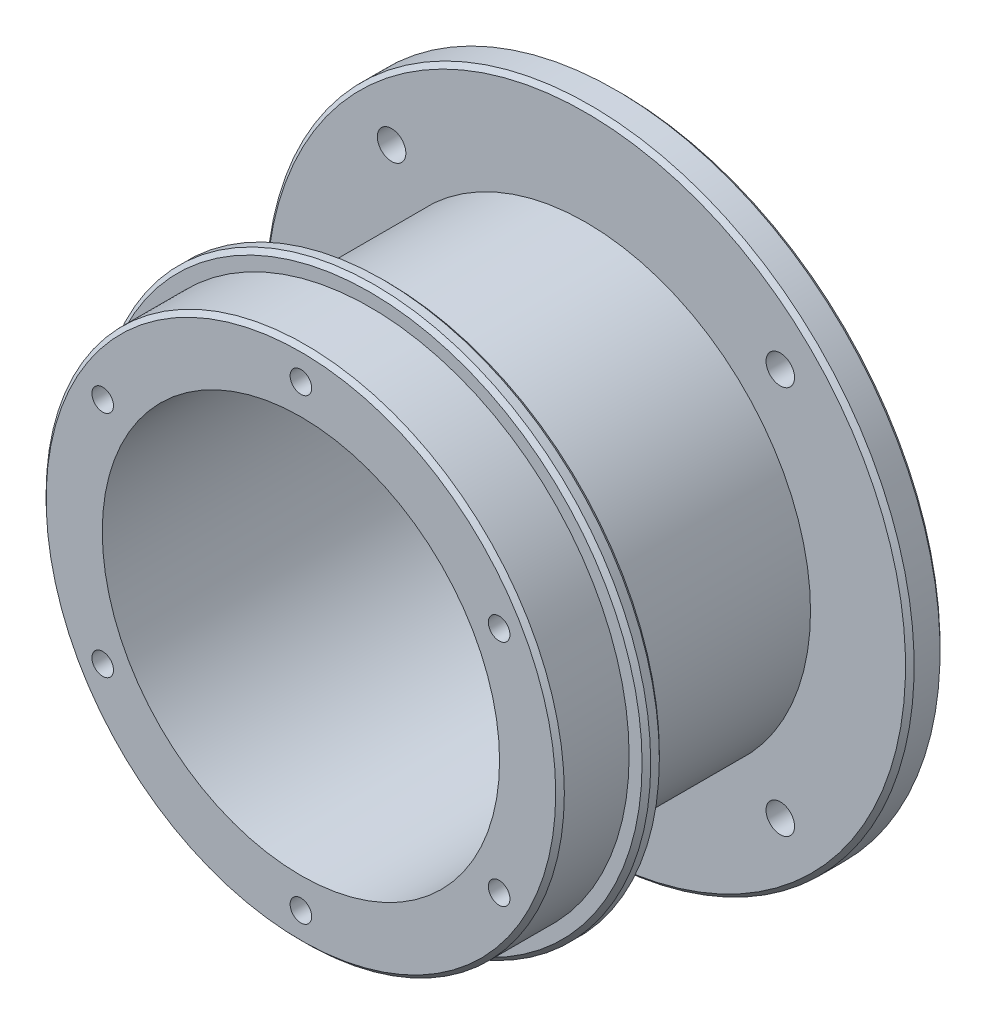
ISO-10303-21;
HEADER;
FILE_DESCRIPTION(('STEP AP214'),'2;1');
FILE_NAME('part.step','',(''),(''),'','','');
FILE_SCHEMA(('AUTOMOTIVE_DESIGN { 1 0 10303 214 1 1 1 1 }'));
ENDSEC;
DATA;
#1=APPLICATION_CONTEXT('core data for automotive mechanical design processes');
#2=APPLICATION_PROTOCOL_DEFINITION('international standard','automotive_design',2000,#1);
#3=PRODUCT_CONTEXT('',#1,'mechanical');
#4=PRODUCT('Part','Part','',(#3));
#5=PRODUCT_RELATED_PRODUCT_CATEGORY('part','',(#4));
#6=PRODUCT_DEFINITION_FORMATION('','',#4);
#7=PRODUCT_DEFINITION_CONTEXT('part definition',#1,'design');
#8=PRODUCT_DEFINITION('design','',#6,#7);
#9=PRODUCT_DEFINITION_SHAPE('','',#8);
#10=(LENGTH_UNIT() NAMED_UNIT(*) SI_UNIT(.MILLI.,.METRE.));
#11=(NAMED_UNIT(*) PLANE_ANGLE_UNIT() SI_UNIT($,.RADIAN.));
#12=(NAMED_UNIT(*) SI_UNIT($,.STERADIAN.) SOLID_ANGLE_UNIT());
#13=UNCERTAINTY_MEASURE_WITH_UNIT(LENGTH_MEASURE(1.E-05),#10,'distance_accuracy_value','');
#14=(GEOMETRIC_REPRESENTATION_CONTEXT(3) GLOBAL_UNCERTAINTY_ASSIGNED_CONTEXT((#13)) GLOBAL_UNIT_ASSIGNED_CONTEXT((#10,
#11,#12)) REPRESENTATION_CONTEXT('',''));
#15=CARTESIAN_POINT('',(0.,0.,0.));
#16=DIRECTION('',(0.,0.,1.));
#17=DIRECTION('',(1.,0.,0.));
#18=AXIS2_PLACEMENT_3D('',#15,#16,#17);
#19=CARTESIAN_POINT('',(0.,0.,0.));
#20=DIRECTION('',(0.,0.,1.));
#21=DIRECTION('',(1.,0.,0.));
#22=AXIS2_PLACEMENT_3D('',#19,#20,#21);
#23=PLANE('',#22);
#24=CARTESIAN_POINT('',(0.,0.,0.));
#25=DIRECTION('',(0.,0.,1.));
#26=DIRECTION('',(1.,0.,0.));
#27=AXIS2_PLACEMENT_3D('',#24,#25,#26);
#28=CIRCLE('',#27,31.5);
#29=CARTESIAN_POINT('',(31.5,0.,0.));
#30=VERTEX_POINT('',#29);
#31=EDGE_CURVE('E156',#30,#30,#28,.F.);
#32=ORIENTED_EDGE('',*,*,#31,.T.);
#33=EDGE_LOOP('',(#32));
#34=FACE_BOUND('',#33,.T.);
#35=CARTESIAN_POINT('',(0.,0.,0.));
#36=DIRECTION('',(0.,0.,1.));
#37=DIRECTION('',(1.,0.,0.));
#38=AXIS2_PLACEMENT_3D('',#35,#36,#37);
#39=CIRCLE('',#38,26.);
#40=CARTESIAN_POINT('',(26.,0.,0.));
#41=VERTEX_POINT('',#40);
#42=EDGE_CURVE('E146',#41,#41,#39,.F.);
#43=ORIENTED_EDGE('',*,*,#42,.F.);
#44=EDGE_LOOP('',(#43));
#45=FACE_BOUND('',#44,.T.);
#46=ADVANCED_FACE('F42',(#34,#45),#23,.F.);
#47=CARTESIAN_POINT('',(0.,0.,2.));
#48=DIRECTION('',(0.,0.,-1.));
#49=DIRECTION('',(-1.,0.,0.));
#50=AXIS2_PLACEMENT_3D('',#47,#48,#49);
#51=CYLINDRICAL_SURFACE('',#50,32.);
#52=CARTESIAN_POINT('',(0.,0.,1.50000000000001));
#53=DIRECTION('',(0.,0.,1.));
#54=DIRECTION('',(1.,0.,0.));
#55=AXIS2_PLACEMENT_3D('',#52,#53,#54);
#56=CIRCLE('',#55,32.);
#57=CARTESIAN_POINT('',(32.,0.,1.50000000000001));
#58=VERTEX_POINT('',#57);
#59=EDGE_CURVE('E11',#58,#58,#56,.F.);
#60=ORIENTED_EDGE('',*,*,#59,.T.);
#61=EDGE_LOOP('',(#60));
#62=FACE_BOUND('',#61,.T.);
#63=CARTESIAN_POINT('',(0.,0.,0.500000000000007));
#64=DIRECTION('',(0.,0.,1.));
#65=DIRECTION('',(1.,0.,0.));
#66=AXIS2_PLACEMENT_3D('',#63,#64,#65);
#67=CIRCLE('',#66,32.);
#68=CARTESIAN_POINT('',(32.,0.,0.500000000000007));
#69=VERTEX_POINT('',#68);
#70=EDGE_CURVE('E149',#69,#69,#67,.T.);
#71=ORIENTED_EDGE('',*,*,#70,.T.);
#72=EDGE_LOOP('',(#71));
#73=FACE_BOUND('',#72,.T.);
#74=ADVANCED_FACE('F192',(#62,#73),#51,.T.);
#75=CARTESIAN_POINT('',(0.,0.,2.));
#76=DIRECTION('',(0.,0.,1.));
#77=DIRECTION('',(1.,0.,0.));
#78=AXIS2_PLACEMENT_3D('',#75,#76,#77);
#79=PLANE('',#78);
#80=CARTESIAN_POINT('',(0.,0.,2.));
#81=DIRECTION('',(0.,0.,1.));
#82=DIRECTION('',(1.,0.,0.));
#83=AXIS2_PLACEMENT_3D('',#80,#81,#82);
#84=CIRCLE('',#83,31.5);
#85=CARTESIAN_POINT('',(31.5,0.,2.));
#86=VERTEX_POINT('',#85);
#87=EDGE_CURVE('E50',#86,#86,#84,.T.);
#88=ORIENTED_EDGE('',*,*,#87,.T.);
#89=EDGE_LOOP('',(#88));
#90=FACE_BOUND('',#89,.T.);
#91=CARTESIAN_POINT('',(0.,0.,2.));
#92=DIRECTION('',(0.,0.,1.));
#93=DIRECTION('',(1.,0.,0.));
#94=AXIS2_PLACEMENT_3D('',#91,#92,#93);
#95=CIRCLE('',#94,30.);
#96=CARTESIAN_POINT('',(30.,0.,2.));
#97=VERTEX_POINT('',#96);
#98=EDGE_CURVE('E143',#97,#97,#95,.T.);
#99=ORIENTED_EDGE('',*,*,#98,.F.);
#100=EDGE_LOOP('',(#99));
#101=FACE_BOUND('',#100,.T.);
#102=ADVANCED_FACE('F179',(#90,#101),#79,.T.);
#103=CARTESIAN_POINT('',(0.,0.,10.));
#104=DIRECTION('',(0.,0.,-1.));
#105=DIRECTION('',(-1.,0.,0.));
#106=AXIS2_PLACEMENT_3D('',#103,#104,#105);
#107=CYLINDRICAL_SURFACE('',#106,30.);
#108=CARTESIAN_POINT('',(0.,0.,9.49999999999998));
#109=DIRECTION('',(0.,0.,1.));
#110=DIRECTION('',(1.,0.,0.));
#111=AXIS2_PLACEMENT_3D('',#108,#109,#110);
#112=CIRCLE('',#111,30.);
#113=CARTESIAN_POINT('',(30.,0.,9.49999999999998));
#114=VERTEX_POINT('',#113);
#115=EDGE_CURVE('E174',#114,#114,#112,.F.);
#116=ORIENTED_EDGE('',*,*,#115,.T.);
#117=EDGE_LOOP('',(#116));
#118=FACE_BOUND('',#117,.T.);
#119=ORIENTED_EDGE('',*,*,#98,.T.);
#120=EDGE_LOOP('',(#119));
#121=FACE_BOUND('',#120,.T.);
#122=ADVANCED_FACE('F250',(#118,#121),#107,.T.);
#123=CARTESIAN_POINT('',(0.,0.,10.));
#124=DIRECTION('',(0.,0.,1.));
#125=DIRECTION('',(1.,0.,0.));
#126=AXIS2_PLACEMENT_3D('',#123,#124,#125);
#127=PLANE('',#126);
#128=CARTESIAN_POINT('',(0.,0.,10.));
#129=DIRECTION('',(0.,0.,1.));
#130=DIRECTION('',(1.,0.,0.));
#131=AXIS2_PLACEMENT_3D('',#128,#129,#130);
#132=CIRCLE('',#131,29.5);
#133=CARTESIAN_POINT('',(29.5,0.,10.));
#134=VERTEX_POINT('',#133);
#135=EDGE_CURVE('E171',#134,#134,#132,.T.);
#136=ORIENTED_EDGE('',*,*,#135,.T.);
#137=EDGE_LOOP('',(#136));
#138=FACE_BOUND('',#137,.T.);
#139=CARTESIAN_POINT('',(0.,-26.5,10.));
#140=DIRECTION('',(0.,0.,1.));
#141=DIRECTION('',(1.,0.,0.));
#142=AXIS2_PLACEMENT_3D('',#139,#140,#141);
#143=CIRCLE('',#142,1.25);
#144=CARTESIAN_POINT('',(1.25,-26.5,10.));
#145=VERTEX_POINT('',#144);
#146=EDGE_CURVE('E80',#145,#145,#143,.T.);
#147=ORIENTED_EDGE('',*,*,#146,.F.);
#148=EDGE_LOOP('',(#147));
#149=FACE_BOUND('',#148,.T.);
#150=CARTESIAN_POINT('',(22.9496732002876,-13.25,10.));
#151=DIRECTION('',(0.,0.,1.));
#152=DIRECTION('',(1.,0.,0.));
#153=AXIS2_PLACEMENT_3D('',#150,#151,#152);
#154=CIRCLE('',#153,1.25);
#155=CARTESIAN_POINT('',(24.1996732002876,-13.25,10.));
#156=VERTEX_POINT('',#155);
#157=EDGE_CURVE('E79',#156,#156,#154,.T.);
#158=ORIENTED_EDGE('',*,*,#157,.F.);
#159=EDGE_LOOP('',(#158));
#160=FACE_BOUND('',#159,.T.);
#161=CARTESIAN_POINT('',(22.9496732002876,13.25,10.));
#162=DIRECTION('',(0.,0.,1.));
#163=DIRECTION('',(1.,0.,0.));
#164=AXIS2_PLACEMENT_3D('',#161,#162,#163);
#165=CIRCLE('',#164,1.25);
#166=CARTESIAN_POINT('',(24.1996732002876,13.25,10.));
#167=VERTEX_POINT('',#166);
#168=EDGE_CURVE('E90',#167,#167,#165,.T.);
#169=ORIENTED_EDGE('',*,*,#168,.F.);
#170=EDGE_LOOP('',(#169));
#171=FACE_BOUND('',#170,.T.);
#172=CARTESIAN_POINT('',(0.,26.5,10.));
#173=DIRECTION('',(0.,0.,1.));
#174=DIRECTION('',(1.,0.,0.));
#175=AXIS2_PLACEMENT_3D('',#172,#173,#174);
#176=CIRCLE('',#175,1.25);
#177=CARTESIAN_POINT('',(1.25,26.5,10.));
#178=VERTEX_POINT('',#177);
#179=EDGE_CURVE('E96',#178,#178,#176,.T.);
#180=ORIENTED_EDGE('',*,*,#179,.F.);
#181=EDGE_LOOP('',(#180));
#182=FACE_BOUND('',#181,.T.);
#183=CARTESIAN_POINT('',(-22.9496732002876,13.25,10.));
#184=DIRECTION('',(0.,0.,1.));
#185=DIRECTION('',(1.,0.,0.));
#186=AXIS2_PLACEMENT_3D('',#183,#184,#185);
#187=CIRCLE('',#186,1.25);
#188=CARTESIAN_POINT('',(-21.6996732002876,13.25,10.));
#189=VERTEX_POINT('',#188);
#190=EDGE_CURVE('E102',#189,#189,#187,.T.);
#191=ORIENTED_EDGE('',*,*,#190,.F.);
#192=EDGE_LOOP('',(#191));
#193=FACE_BOUND('',#192,.T.);
#194=CARTESIAN_POINT('',(-22.9496732002876,-13.25,10.));
#195=DIRECTION('',(0.,0.,1.));
#196=DIRECTION('',(1.,0.,0.));
#197=AXIS2_PLACEMENT_3D('',#194,#195,#196);
#198=CIRCLE('',#197,1.25);
#199=CARTESIAN_POINT('',(-21.6996732002876,-13.25,10.));
#200=VERTEX_POINT('',#199);
#201=EDGE_CURVE('E108',#200,#200,#198,.T.);
#202=ORIENTED_EDGE('',*,*,#201,.F.);
#203=EDGE_LOOP('',(#202));
#204=FACE_BOUND('',#203,.T.);
#205=CARTESIAN_POINT('',(0.,0.,10.));
#206=DIRECTION('',(0.,0.,-1.));
#207=DIRECTION('',(-1.,0.,0.));
#208=AXIS2_PLACEMENT_3D('',#205,#206,#207);
#209=CIRCLE('',#208,23.);
#210=CARTESIAN_POINT('',(-23.,0.,10.));
#211=VERTEX_POINT('',#210);
#212=EDGE_CURVE('E140',#211,#211,#209,.T.);
#213=ORIENTED_EDGE('',*,*,#212,.T.);
#214=EDGE_LOOP('',(#213));
#215=FACE_BOUND('',#214,.T.);
#216=ADVANCED_FACE('F241',(#138,#149,#160,#171,#182,#193,#204,#215),#127,.T.);
#217=CARTESIAN_POINT('',(0.,0.,10.));
#218=DIRECTION('',(0.,0.,-1.));
#219=DIRECTION('',(-1.,0.,0.));
#220=AXIS2_PLACEMENT_3D('',#217,#218,#219);
#221=CYLINDRICAL_SURFACE('',#220,23.);
#222=ORIENTED_EDGE('',*,*,#212,.F.);
#223=EDGE_LOOP('',(#222));
#224=FACE_BOUND('',#223,.T.);
#225=CARTESIAN_POINT('',(0.,0.,-27.));
#226=DIRECTION('',(0.,0.,-1.));
#227=DIRECTION('',(-1.,0.,0.));
#228=AXIS2_PLACEMENT_3D('',#225,#226,#227);
#229=CIRCLE('',#228,23.);
#230=CARTESIAN_POINT('',(-23.,0.,-27.));
#231=VERTEX_POINT('',#230);
#232=EDGE_CURVE('E134',#231,#231,#229,.F.);
#233=ORIENTED_EDGE('',*,*,#232,.F.);
#234=EDGE_LOOP('',(#233));
#235=FACE_BOUND('',#234,.T.);
#236=ADVANCED_FACE('F238',(#224,#235),#221,.F.);
#237=CARTESIAN_POINT('',(0.,0.,-23.));
#238=DIRECTION('',(0.,0.,1.));
#239=DIRECTION('',(1.,0.,0.));
#240=AXIS2_PLACEMENT_3D('',#237,#238,#239);
#241=CYLINDRICAL_SURFACE('',#240,26.);
#242=CARTESIAN_POINT('',(0.,0.,-23.));
#243=DIRECTION('',(0.,0.,-1.));
#244=DIRECTION('',(-1.,0.,0.));
#245=AXIS2_PLACEMENT_3D('',#242,#243,#244);
#246=CIRCLE('',#245,26.);
#247=CARTESIAN_POINT('',(-26.,0.,-23.));
#248=VERTEX_POINT('',#247);
#249=EDGE_CURVE('E137',#248,#248,#246,.T.);
#250=ORIENTED_EDGE('',*,*,#249,.F.);
#251=EDGE_LOOP('',(#250));
#252=FACE_BOUND('',#251,.T.);
#253=ORIENTED_EDGE('',*,*,#42,.T.);
#254=EDGE_LOOP('',(#253));
#255=FACE_BOUND('',#254,.T.);
#256=ADVANCED_FACE('F240',(#252,#255),#241,.T.);
#257=CARTESIAN_POINT('',(0.,0.,-27.));
#258=DIRECTION('',(0.,0.,1.));
#259=DIRECTION('',(1.,0.,0.));
#260=AXIS2_PLACEMENT_3D('',#257,#258,#259);
#261=CYLINDRICAL_SURFACE('',#260,37.5);
#262=CARTESIAN_POINT('',(0.,0.,-23.5));
#263=DIRECTION('',(0.,0.,-1.));
#264=DIRECTION('',(-1.,0.,0.));
#265=AXIS2_PLACEMENT_3D('',#262,#263,#264);
#266=CIRCLE('',#265,37.5);
#267=CARTESIAN_POINT('',(-37.5,0.,-23.5));
#268=VERTEX_POINT('',#267);
#269=EDGE_CURVE('E162',#268,#268,#266,.T.);
#270=ORIENTED_EDGE('',*,*,#269,.T.);
#271=EDGE_LOOP('',(#270));
#272=FACE_BOUND('',#271,.T.);
#273=CARTESIAN_POINT('',(0.,0.,-26.5));
#274=DIRECTION('',(0.,0.,-1.));
#275=DIRECTION('',(-1.,0.,0.));
#276=AXIS2_PLACEMENT_3D('',#273,#274,#275);
#277=CIRCLE('',#276,37.5);
#278=CARTESIAN_POINT('',(-37.5,0.,-26.5));
#279=VERTEX_POINT('',#278);
#280=EDGE_CURVE('E159',#279,#279,#277,.F.);
#281=ORIENTED_EDGE('',*,*,#280,.T.);
#282=EDGE_LOOP('',(#281));
#283=FACE_BOUND('',#282,.T.);
#284=ADVANCED_FACE('F226',(#272,#283),#261,.T.);
#285=CARTESIAN_POINT('',(0.,0.,-27.));
#286=DIRECTION('',(0.,0.,-1.));
#287=DIRECTION('',(-1.,0.,0.));
#288=AXIS2_PLACEMENT_3D('',#285,#286,#287);
#289=PLANE('',#288);
#290=CARTESIAN_POINT('',(0.,0.,-27.));
#291=DIRECTION('',(0.,0.,-1.));
#292=DIRECTION('',(-1.,0.,0.));
#293=AXIS2_PLACEMENT_3D('',#290,#291,#292);
#294=CIRCLE('',#293,37.);
#295=CARTESIAN_POINT('',(-37.,0.,-27.));
#296=VERTEX_POINT('',#295);
#297=EDGE_CURVE('E168',#296,#296,#294,.T.);
#298=ORIENTED_EDGE('',*,*,#297,.T.);
#299=EDGE_LOOP('',(#298));
#300=FACE_BOUND('',#299,.T.);
#301=CARTESIAN_POINT('',(-22.5,-22.5,-27.));
#302=DIRECTION('',(0.,0.,-1.));
#303=DIRECTION('',(-1.,0.,0.));
#304=AXIS2_PLACEMENT_3D('',#301,#302,#303);
#305=CIRCLE('',#304,1.64999999999999);
#306=CARTESIAN_POINT('',(-24.15,-22.5,-27.));
#307=VERTEX_POINT('',#306);
#308=EDGE_CURVE('E114',#307,#307,#305,.T.);
#309=ORIENTED_EDGE('',*,*,#308,.F.);
#310=EDGE_LOOP('',(#309));
#311=FACE_BOUND('',#310,.T.);
#312=CARTESIAN_POINT('',(-22.5,22.5,-27.));
#313=DIRECTION('',(0.,0.,-1.));
#314=DIRECTION('',(-1.,0.,0.));
#315=AXIS2_PLACEMENT_3D('',#312,#313,#314);
#316=CIRCLE('',#315,1.64999999999999);
#317=CARTESIAN_POINT('',(-24.15,22.5,-27.));
#318=VERTEX_POINT('',#317);
#319=EDGE_CURVE('E118',#318,#318,#316,.T.);
#320=ORIENTED_EDGE('',*,*,#319,.F.);
#321=EDGE_LOOP('',(#320));
#322=FACE_BOUND('',#321,.T.);
#323=CARTESIAN_POINT('',(22.5,-22.5,-27.));
#324=DIRECTION('',(0.,0.,-1.));
#325=DIRECTION('',(-1.,0.,0.));
#326=AXIS2_PLACEMENT_3D('',#323,#324,#325);
#327=CIRCLE('',#326,1.64999999999999);
#328=CARTESIAN_POINT('',(20.85,-22.5,-27.));
#329=VERTEX_POINT('',#328);
#330=EDGE_CURVE('E122',#329,#329,#327,.T.);
#331=ORIENTED_EDGE('',*,*,#330,.F.);
#332=EDGE_LOOP('',(#331));
#333=FACE_BOUND('',#332,.T.);
#334=CARTESIAN_POINT('',(22.5,22.5,-27.));
#335=DIRECTION('',(0.,0.,-1.));
#336=DIRECTION('',(-1.,0.,0.));
#337=AXIS2_PLACEMENT_3D('',#334,#335,#336);
#338=CIRCLE('',#337,1.64999999999999);
#339=CARTESIAN_POINT('',(20.85,22.5,-27.));
#340=VERTEX_POINT('',#339);
#341=EDGE_CURVE('E128',#340,#340,#338,.T.);
#342=ORIENTED_EDGE('',*,*,#341,.F.);
#343=EDGE_LOOP('',(#342));
#344=FACE_BOUND('',#343,.T.);
#345=ORIENTED_EDGE('',*,*,#232,.T.);
#346=EDGE_LOOP('',(#345));
#347=FACE_BOUND('',#346,.T.);
#348=ADVANCED_FACE('F222',(#300,#311,#322,#333,#344,#347),#289,.T.);
#349=CARTESIAN_POINT('',(0.,0.,-23.));
#350=DIRECTION('',(0.,0.,-1.));
#351=DIRECTION('',(-1.,0.,0.));
#352=AXIS2_PLACEMENT_3D('',#349,#350,#351);
#353=PLANE('',#352);
#354=CARTESIAN_POINT('',(0.,0.,-23.));
#355=DIRECTION('',(0.,0.,-1.));
#356=DIRECTION('',(-1.,0.,0.));
#357=AXIS2_PLACEMENT_3D('',#354,#355,#356);
#358=CIRCLE('',#357,37.);
#359=CARTESIAN_POINT('',(-37.,0.,-23.));
#360=VERTEX_POINT('',#359);
#361=EDGE_CURVE('E165',#360,#360,#358,.F.);
#362=ORIENTED_EDGE('',*,*,#361,.T.);
#363=EDGE_LOOP('',(#362));
#364=FACE_BOUND('',#363,.T.);
#365=CARTESIAN_POINT('',(-22.5,-22.5,-23.));
#366=DIRECTION('',(0.,0.,-1.));
#367=DIRECTION('',(-1.,0.,0.));
#368=AXIS2_PLACEMENT_3D('',#365,#366,#367);
#369=CIRCLE('',#368,1.64999999999999);
#370=CARTESIAN_POINT('',(-24.15,-22.5,-23.));
#371=VERTEX_POINT('',#370);
#372=EDGE_CURVE('E117',#371,#371,#369,.T.);
#373=ORIENTED_EDGE('',*,*,#372,.T.);
#374=EDGE_LOOP('',(#373));
#375=FACE_BOUND('',#374,.T.);
#376=CARTESIAN_POINT('',(-22.5,22.5,-23.));
#377=DIRECTION('',(0.,0.,-1.));
#378=DIRECTION('',(-1.,0.,0.));
#379=AXIS2_PLACEMENT_3D('',#376,#377,#378);
#380=CIRCLE('',#379,1.65);
#381=CARTESIAN_POINT('',(-24.15,22.5,-23.));
#382=VERTEX_POINT('',#381);
#383=EDGE_CURVE('E121',#382,#382,#380,.T.);
#384=ORIENTED_EDGE('',*,*,#383,.T.);
#385=EDGE_LOOP('',(#384));
#386=FACE_BOUND('',#385,.T.);
#387=CARTESIAN_POINT('',(22.5,-22.5,-23.));
#388=DIRECTION('',(0.,0.,-1.));
#389=DIRECTION('',(-1.,0.,0.));
#390=AXIS2_PLACEMENT_3D('',#387,#388,#389);
#391=CIRCLE('',#390,1.64999999999999);
#392=CARTESIAN_POINT('',(20.85,-22.5,-23.));
#393=VERTEX_POINT('',#392);
#394=EDGE_CURVE('E125',#393,#393,#391,.T.);
#395=ORIENTED_EDGE('',*,*,#394,.T.);
#396=EDGE_LOOP('',(#395));
#397=FACE_BOUND('',#396,.T.);
#398=CARTESIAN_POINT('',(22.5,22.5,-23.));
#399=DIRECTION('',(0.,0.,-1.));
#400=DIRECTION('',(-1.,0.,0.));
#401=AXIS2_PLACEMENT_3D('',#398,#399,#400);
#402=CIRCLE('',#401,1.65);
#403=CARTESIAN_POINT('',(20.85,22.5,-23.));
#404=VERTEX_POINT('',#403);
#405=EDGE_CURVE('E131',#404,#404,#402,.T.);
#406=ORIENTED_EDGE('',*,*,#405,.T.);
#407=EDGE_LOOP('',(#406));
#408=FACE_BOUND('',#407,.T.);
#409=ORIENTED_EDGE('',*,*,#249,.T.);
#410=EDGE_LOOP('',(#409));
#411=FACE_BOUND('',#410,.T.);
#412=ADVANCED_FACE('F225',(#364,#375,#386,#397,#408,#411),#353,.F.);
#413=CARTESIAN_POINT('',(22.5,22.5,-27.));
#414=DIRECTION('',(0.,0.,-1.));
#415=DIRECTION('',(-1.,0.,0.));
#416=AXIS2_PLACEMENT_3D('',#413,#414,#415);
#417=CYLINDRICAL_SURFACE('',#416,1.65);
#418=ORIENTED_EDGE('',*,*,#341,.T.);
#419=EDGE_LOOP('',(#418));
#420=FACE_BOUND('',#419,.T.);
#421=ORIENTED_EDGE('',*,*,#405,.F.);
#422=EDGE_LOOP('',(#421));
#423=FACE_BOUND('',#422,.T.);
#424=ADVANCED_FACE('F304',(#420,#423),#417,.F.);
#425=CARTESIAN_POINT('',(22.5,-22.5,-27.));
#426=DIRECTION('',(0.,0.,-1.));
#427=DIRECTION('',(-1.,0.,0.));
#428=AXIS2_PLACEMENT_3D('',#425,#426,#427);
#429=CYLINDRICAL_SURFACE('',#428,1.64999999999999);
#430=ORIENTED_EDGE('',*,*,#330,.T.);
#431=EDGE_LOOP('',(#430));
#432=FACE_BOUND('',#431,.T.);
#433=ORIENTED_EDGE('',*,*,#394,.F.);
#434=EDGE_LOOP('',(#433));
#435=FACE_BOUND('',#434,.T.);
#436=ADVANCED_FACE('F300',(#432,#435),#429,.F.);
#437=CARTESIAN_POINT('',(-22.5,22.5,-27.));
#438=DIRECTION('',(0.,0.,-1.));
#439=DIRECTION('',(-1.,0.,0.));
#440=AXIS2_PLACEMENT_3D('',#437,#438,#439);
#441=CYLINDRICAL_SURFACE('',#440,1.65);
#442=ORIENTED_EDGE('',*,*,#319,.T.);
#443=EDGE_LOOP('',(#442));
#444=FACE_BOUND('',#443,.T.);
#445=ORIENTED_EDGE('',*,*,#383,.F.);
#446=EDGE_LOOP('',(#445));
#447=FACE_BOUND('',#446,.T.);
#448=ADVANCED_FACE('F296',(#444,#447),#441,.F.);
#449=CARTESIAN_POINT('',(-22.5,-22.5,-27.));
#450=DIRECTION('',(0.,0.,-1.));
#451=DIRECTION('',(-1.,0.,0.));
#452=AXIS2_PLACEMENT_3D('',#449,#450,#451);
#453=CYLINDRICAL_SURFACE('',#452,1.64999999999999);
#454=ORIENTED_EDGE('',*,*,#308,.T.);
#455=EDGE_LOOP('',(#454));
#456=FACE_BOUND('',#455,.T.);
#457=ORIENTED_EDGE('',*,*,#372,.F.);
#458=EDGE_LOOP('',(#457));
#459=FACE_BOUND('',#458,.T.);
#460=ADVANCED_FACE('F208',(#456,#459),#453,.F.);
#461=CARTESIAN_POINT('',(0.,0.,0.500000000000007));
#462=DIRECTION('',(0.,0.,1.));
#463=DIRECTION('',(1.,0.,0.));
#464=AXIS2_PLACEMENT_3D('',#461,#462,#463);
#465=CONICAL_SURFACE('',#464,32.,0.785398163397441);
#466=ORIENTED_EDGE('',*,*,#31,.F.);
#467=EDGE_LOOP('',(#466));
#468=FACE_BOUND('',#467,.T.);
#469=ORIENTED_EDGE('',*,*,#70,.F.);
#470=EDGE_LOOP('',(#469));
#471=FACE_BOUND('',#470,.T.);
#472=ADVANCED_FACE('F204',(#468,#471),#465,.T.);
#473=CARTESIAN_POINT('',(-22.9496732002876,-13.25,4.));
#474=DIRECTION('',(0.,0.,1.));
#475=DIRECTION('',(1.,0.,0.));
#476=AXIS2_PLACEMENT_3D('',#473,#474,#475);
#477=CONICAL_SURFACE('',#476,1.25,1.02974425867665);
#478=CARTESIAN_POINT('',(-22.9496732002876,-13.25,3.24892422621555));
#479=VERTEX_POINT('',#478);
#480=VERTEX_LOOP('',#479);
#481=FACE_BOUND('',#480,.T.);
#482=CARTESIAN_POINT('',(-22.9496732002876,-13.25,4.));
#483=DIRECTION('',(0.,0.,1.));
#484=DIRECTION('',(1.,0.,0.));
#485=AXIS2_PLACEMENT_3D('',#482,#483,#484);
#486=CIRCLE('',#485,1.25);
#487=CARTESIAN_POINT('',(-21.6996732002876,-13.25,4.));
#488=VERTEX_POINT('',#487);
#489=EDGE_CURVE('E111',#488,#488,#486,.T.);
#490=ORIENTED_EDGE('',*,*,#489,.T.);
#491=EDGE_LOOP('',(#490));
#492=FACE_BOUND('',#491,.T.);
#493=ADVANCED_FACE('F207',(#481,#492),#477,.F.);
#494=CARTESIAN_POINT('',(-22.9496732002876,-13.25,10.));
#495=DIRECTION('',(0.,0.,1.));
#496=DIRECTION('',(1.,0.,0.));
#497=AXIS2_PLACEMENT_3D('',#494,#495,#496);
#498=CYLINDRICAL_SURFACE('',#497,1.25);
#499=ORIENTED_EDGE('',*,*,#489,.F.);
#500=EDGE_LOOP('',(#499));
#501=FACE_BOUND('',#500,.T.);
#502=ORIENTED_EDGE('',*,*,#201,.T.);
#503=EDGE_LOOP('',(#502));
#504=FACE_BOUND('',#503,.T.);
#505=ADVANCED_FACE('F279',(#501,#504),#498,.F.);
#506=CARTESIAN_POINT('',(-22.9496732002876,13.25,4.));
#507=DIRECTION('',(0.,0.,1.));
#508=DIRECTION('',(1.,0.,0.));
#509=AXIS2_PLACEMENT_3D('',#506,#507,#508);
#510=CONICAL_SURFACE('',#509,1.25,1.02974425867665);
#511=CARTESIAN_POINT('',(-22.9496732002876,13.25,3.24892422621555));
#512=VERTEX_POINT('',#511);
#513=VERTEX_LOOP('',#512);
#514=FACE_BOUND('',#513,.T.);
#515=CARTESIAN_POINT('',(-22.9496732002876,13.25,4.));
#516=DIRECTION('',(0.,0.,1.));
#517=DIRECTION('',(1.,0.,0.));
#518=AXIS2_PLACEMENT_3D('',#515,#516,#517);
#519=CIRCLE('',#518,1.25);
#520=CARTESIAN_POINT('',(-21.6996732002876,13.25,4.));
#521=VERTEX_POINT('',#520);
#522=EDGE_CURVE('E105',#521,#521,#519,.T.);
#523=ORIENTED_EDGE('',*,*,#522,.T.);
#524=EDGE_LOOP('',(#523));
#525=FACE_BOUND('',#524,.T.);
#526=ADVANCED_FACE('F281',(#514,#525),#510,.F.);
#527=CARTESIAN_POINT('',(-22.9496732002876,13.25,10.));
#528=DIRECTION('',(0.,0.,1.));
#529=DIRECTION('',(1.,0.,0.));
#530=AXIS2_PLACEMENT_3D('',#527,#528,#529);
#531=CYLINDRICAL_SURFACE('',#530,1.25);
#532=ORIENTED_EDGE('',*,*,#522,.F.);
#533=EDGE_LOOP('',(#532));
#534=FACE_BOUND('',#533,.T.);
#535=ORIENTED_EDGE('',*,*,#190,.T.);
#536=EDGE_LOOP('',(#535));
#537=FACE_BOUND('',#536,.T.);
#538=ADVANCED_FACE('F288',(#534,#537),#531,.F.);
#539=CARTESIAN_POINT('',(0.,26.5,4.));
#540=DIRECTION('',(0.,0.,1.));
#541=DIRECTION('',(1.,0.,0.));
#542=AXIS2_PLACEMENT_3D('',#539,#540,#541);
#543=CONICAL_SURFACE('',#542,1.25,1.02974425867665);
#544=CARTESIAN_POINT('',(0.,26.5,3.24892422621555));
#545=VERTEX_POINT('',#544);
#546=VERTEX_LOOP('',#545);
#547=FACE_BOUND('',#546,.T.);
#548=CARTESIAN_POINT('',(0.,26.5,4.));
#549=DIRECTION('',(0.,0.,1.));
#550=DIRECTION('',(1.,0.,0.));
#551=AXIS2_PLACEMENT_3D('',#548,#549,#550);
#552=CIRCLE('',#551,1.25);
#553=CARTESIAN_POINT('',(1.24999999999999,26.5,4.));
#554=VERTEX_POINT('',#553);
#555=EDGE_CURVE('E99',#554,#554,#552,.T.);
#556=ORIENTED_EDGE('',*,*,#555,.T.);
#557=EDGE_LOOP('',(#556));
#558=FACE_BOUND('',#557,.T.);
#559=ADVANCED_FACE('F379',(#547,#558),#543,.F.);
#560=CARTESIAN_POINT('',(0.,26.5,10.));
#561=DIRECTION('',(0.,0.,1.));
#562=DIRECTION('',(1.,0.,0.));
#563=AXIS2_PLACEMENT_3D('',#560,#561,#562);
#564=CYLINDRICAL_SURFACE('',#563,1.25);
#565=ORIENTED_EDGE('',*,*,#555,.F.);
#566=EDGE_LOOP('',(#565));
#567=FACE_BOUND('',#566,.T.);
#568=ORIENTED_EDGE('',*,*,#179,.T.);
#569=EDGE_LOOP('',(#568));
#570=FACE_BOUND('',#569,.T.);
#571=ADVANCED_FACE('F390',(#567,#570),#564,.F.);
#572=CARTESIAN_POINT('',(22.9496732002876,13.25,4.));
#573=DIRECTION('',(0.,0.,1.));
#574=DIRECTION('',(1.,0.,0.));
#575=AXIS2_PLACEMENT_3D('',#572,#573,#574);
#576=CONICAL_SURFACE('',#575,1.25,1.02974425867665);
#577=CARTESIAN_POINT('',(22.9496732002876,13.25,3.24892422621555));
#578=VERTEX_POINT('',#577);
#579=VERTEX_LOOP('',#578);
#580=FACE_BOUND('',#579,.T.);
#581=CARTESIAN_POINT('',(22.9496732002876,13.25,4.));
#582=DIRECTION('',(0.,0.,1.));
#583=DIRECTION('',(1.,0.,0.));
#584=AXIS2_PLACEMENT_3D('',#581,#582,#583);
#585=CIRCLE('',#584,1.25);
#586=CARTESIAN_POINT('',(24.1996732002876,13.25,4.));
#587=VERTEX_POINT('',#586);
#588=EDGE_CURVE('E93',#587,#587,#585,.T.);
#589=ORIENTED_EDGE('',*,*,#588,.T.);
#590=EDGE_LOOP('',(#589));
#591=FACE_BOUND('',#590,.T.);
#592=ADVANCED_FACE('F400',(#580,#591),#576,.F.);
#593=CARTESIAN_POINT('',(22.9496732002876,13.25,10.));
#594=DIRECTION('',(0.,0.,1.));
#595=DIRECTION('',(1.,0.,0.));
#596=AXIS2_PLACEMENT_3D('',#593,#594,#595);
#597=CYLINDRICAL_SURFACE('',#596,1.25);
#598=ORIENTED_EDGE('',*,*,#588,.F.);
#599=EDGE_LOOP('',(#598));
#600=FACE_BOUND('',#599,.T.);
#601=ORIENTED_EDGE('',*,*,#168,.T.);
#602=EDGE_LOOP('',(#601));
#603=FACE_BOUND('',#602,.T.);
#604=ADVANCED_FACE('F412',(#600,#603),#597,.F.);
#605=CARTESIAN_POINT('',(22.9496732002876,-13.25,4.));
#606=DIRECTION('',(0.,0.,1.));
#607=DIRECTION('',(1.,0.,0.));
#608=AXIS2_PLACEMENT_3D('',#605,#606,#607);
#609=CONICAL_SURFACE('',#608,1.25,1.02974425867665);
#610=CARTESIAN_POINT('',(22.9496732002876,-13.25,3.24892422621555));
#611=VERTEX_POINT('',#610);
#612=VERTEX_LOOP('',#611);
#613=FACE_BOUND('',#612,.T.);
#614=CARTESIAN_POINT('',(22.9496732002876,-13.25,4.));
#615=DIRECTION('',(0.,0.,1.));
#616=DIRECTION('',(1.,0.,0.));
#617=AXIS2_PLACEMENT_3D('',#614,#615,#616);
#618=CIRCLE('',#617,1.25);
#619=CARTESIAN_POINT('',(24.1996732002876,-13.25,4.));
#620=VERTEX_POINT('',#619);
#621=EDGE_CURVE('E83',#620,#620,#618,.T.);
#622=ORIENTED_EDGE('',*,*,#621,.T.);
#623=EDGE_LOOP('',(#622));
#624=FACE_BOUND('',#623,.T.);
#625=ADVANCED_FACE('F422',(#613,#624),#609,.F.);
#626=CARTESIAN_POINT('',(22.9496732002876,-13.25,10.));
#627=DIRECTION('',(0.,0.,1.));
#628=DIRECTION('',(1.,0.,0.));
#629=AXIS2_PLACEMENT_3D('',#626,#627,#628);
#630=CYLINDRICAL_SURFACE('',#629,1.25);
#631=ORIENTED_EDGE('',*,*,#621,.F.);
#632=EDGE_LOOP('',(#631));
#633=FACE_BOUND('',#632,.T.);
#634=ORIENTED_EDGE('',*,*,#157,.T.);
#635=EDGE_LOOP('',(#634));
#636=FACE_BOUND('',#635,.T.);
#637=ADVANCED_FACE('F73',(#633,#636),#630,.F.);
#638=CARTESIAN_POINT('',(0.,-26.5,4.));
#639=DIRECTION('',(0.,0.,1.));
#640=DIRECTION('',(1.,0.,0.));
#641=AXIS2_PLACEMENT_3D('',#638,#639,#640);
#642=CONICAL_SURFACE('',#641,1.25,1.02974425867665);
#643=CARTESIAN_POINT('',(0.,-26.5,3.24892422621555));
#644=VERTEX_POINT('',#643);
#645=VERTEX_LOOP('',#644);
#646=FACE_BOUND('',#645,.T.);
#647=CARTESIAN_POINT('',(0.,-26.5,4.));
#648=DIRECTION('',(0.,0.,1.));
#649=DIRECTION('',(1.,0.,0.));
#650=AXIS2_PLACEMENT_3D('',#647,#648,#649);
#651=CIRCLE('',#650,1.25);
#652=CARTESIAN_POINT('',(1.25,-26.5,4.));
#653=VERTEX_POINT('',#652);
#654=EDGE_CURVE('E77',#653,#653,#651,.T.);
#655=ORIENTED_EDGE('',*,*,#654,.T.);
#656=EDGE_LOOP('',(#655));
#657=FACE_BOUND('',#656,.T.);
#658=ADVANCED_FACE('F69',(#646,#657),#642,.F.);
#659=CARTESIAN_POINT('',(0.,-26.5,10.));
#660=DIRECTION('',(0.,0.,1.));
#661=DIRECTION('',(1.,0.,0.));
#662=AXIS2_PLACEMENT_3D('',#659,#660,#661);
#663=CYLINDRICAL_SURFACE('',#662,1.25);
#664=ORIENTED_EDGE('',*,*,#654,.F.);
#665=EDGE_LOOP('',(#664));
#666=FACE_BOUND('',#665,.T.);
#667=ORIENTED_EDGE('',*,*,#146,.T.);
#668=EDGE_LOOP('',(#667));
#669=FACE_BOUND('',#668,.T.);
#670=ADVANCED_FACE('F72',(#666,#669),#663,.F.);
#671=CARTESIAN_POINT('',(0.,0.,-23.5));
#672=DIRECTION('',(0.,0.,-1.));
#673=DIRECTION('',(-1.,0.,0.));
#674=AXIS2_PLACEMENT_3D('',#671,#672,#673);
#675=CONICAL_SURFACE('',#674,37.5,0.785398163397441);
#676=ORIENTED_EDGE('',*,*,#361,.F.);
#677=EDGE_LOOP('',(#676));
#678=FACE_BOUND('',#677,.T.);
#679=ORIENTED_EDGE('',*,*,#269,.F.);
#680=EDGE_LOOP('',(#679));
#681=FACE_BOUND('',#680,.T.);
#682=ADVANCED_FACE('F210',(#678,#681),#675,.T.);
#683=CARTESIAN_POINT('',(0.,0.,-27.));
#684=DIRECTION('',(0.,0.,1.));
#685=DIRECTION('',(1.,0.,0.));
#686=AXIS2_PLACEMENT_3D('',#683,#684,#685);
#687=CONICAL_SURFACE('',#686,37.,0.785398163397455);
#688=ORIENTED_EDGE('',*,*,#280,.F.);
#689=EDGE_LOOP('',(#688));
#690=FACE_BOUND('',#689,.T.);
#691=ORIENTED_EDGE('',*,*,#297,.F.);
#692=EDGE_LOOP('',(#691));
#693=FACE_BOUND('',#692,.T.);
#694=ADVANCED_FACE('F188',(#690,#693),#687,.T.);
#695=CARTESIAN_POINT('',(0.,0.,10.));
#696=DIRECTION('',(0.,0.,-1.));
#697=DIRECTION('',(-1.,0.,0.));
#698=AXIS2_PLACEMENT_3D('',#695,#696,#697);
#699=CONICAL_SURFACE('',#698,29.5,0.785398163397455);
#700=ORIENTED_EDGE('',*,*,#115,.F.);
#701=EDGE_LOOP('',(#700));
#702=FACE_BOUND('',#701,.T.);
#703=ORIENTED_EDGE('',*,*,#135,.F.);
#704=EDGE_LOOP('',(#703));
#705=FACE_BOUND('',#704,.T.);
#706=ADVANCED_FACE('F183',(#702,#705),#699,.T.);
#707=CARTESIAN_POINT('',(0.,0.,2.));
#708=DIRECTION('',(0.,0.,-1.));
#709=DIRECTION('',(-1.,0.,0.));
#710=AXIS2_PLACEMENT_3D('',#707,#708,#709);
#711=CONICAL_SURFACE('',#710,31.5,0.785398163397448);
#712=ORIENTED_EDGE('',*,*,#59,.F.);
#713=EDGE_LOOP('',(#712));
#714=FACE_BOUND('',#713,.T.);
#715=ORIENTED_EDGE('',*,*,#87,.F.);
#716=EDGE_LOOP('',(#715));
#717=FACE_BOUND('',#716,.T.);
#718=ADVANCED_FACE('F44',(#714,#717),#711,.T.);
#719=CLOSED_SHELL('',(#46,#74,#102,#122,#216,#236,#256,#284,#348,#412,#424,#436,#448,#460,#472,
#493,#505,#526,#538,#559,#571,#592,#604,#625,#637,#658,#670,#682,#694,#706,#718));
#720=MANIFOLD_SOLID_BREP('B2',#719);
#721=ADVANCED_BREP_SHAPE_REPRESENTATION('',(#18,#720),#14);
#722=SHAPE_DEFINITION_REPRESENTATION(#9,#721);
ENDSEC;
END-ISO-10303-21;
